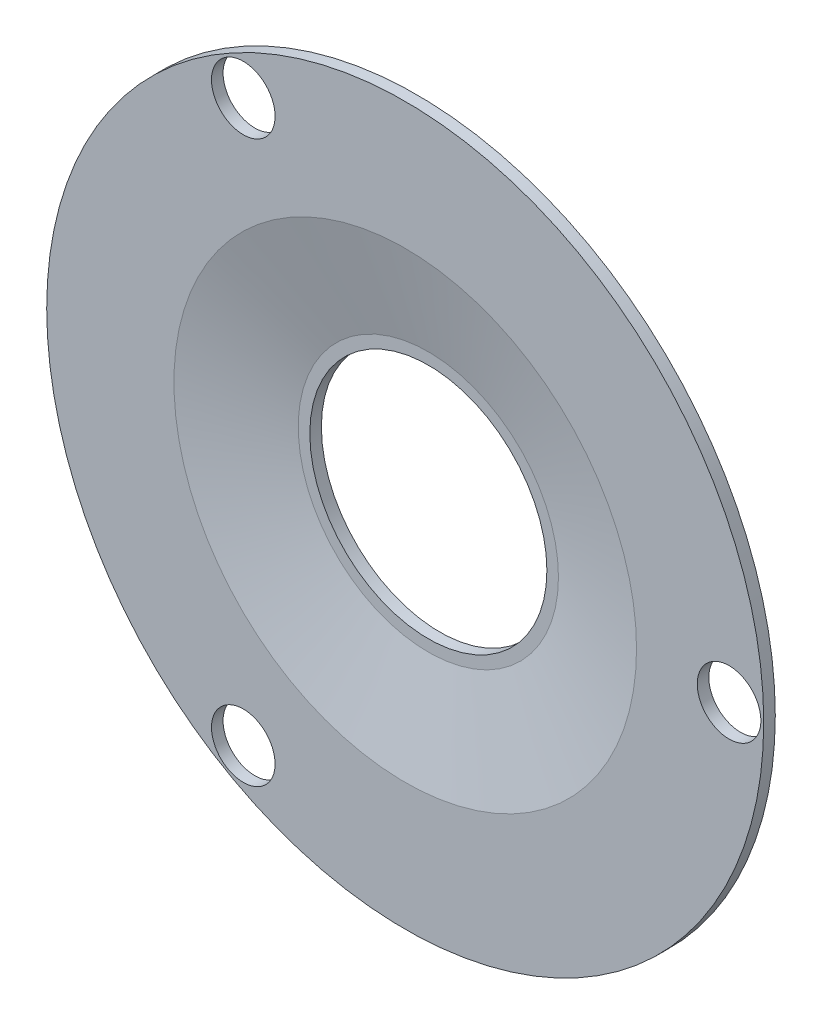
ISO-10303-21;
HEADER;
FILE_DESCRIPTION(('STEP AP214'),'2;1');
FILE_NAME('part.step','',(''),(''),'','','');
FILE_SCHEMA(('AUTOMOTIVE_DESIGN { 1 0 10303 214 1 1 1 1 }'));
ENDSEC;
DATA;
#1=APPLICATION_CONTEXT('core data for automotive mechanical design processes');
#2=APPLICATION_PROTOCOL_DEFINITION('international standard','automotive_design',2000,#1);
#3=PRODUCT_CONTEXT('',#1,'mechanical');
#4=PRODUCT('Part','Part','',(#3));
#5=PRODUCT_RELATED_PRODUCT_CATEGORY('part','',(#4));
#6=PRODUCT_DEFINITION_FORMATION('','',#4);
#7=PRODUCT_DEFINITION_CONTEXT('part definition',#1,'design');
#8=PRODUCT_DEFINITION('design','',#6,#7);
#9=PRODUCT_DEFINITION_SHAPE('','',#8);
#10=(LENGTH_UNIT() NAMED_UNIT(*) SI_UNIT(.MILLI.,.METRE.));
#11=(NAMED_UNIT(*) PLANE_ANGLE_UNIT() SI_UNIT($,.RADIAN.));
#12=(NAMED_UNIT(*) SI_UNIT($,.STERADIAN.) SOLID_ANGLE_UNIT());
#13=UNCERTAINTY_MEASURE_WITH_UNIT(LENGTH_MEASURE(1.E-05),#10,'distance_accuracy_value','');
#14=(GEOMETRIC_REPRESENTATION_CONTEXT(3) GLOBAL_UNCERTAINTY_ASSIGNED_CONTEXT((#13)) GLOBAL_UNIT_ASSIGNED_CONTEXT((#10,
#11,#12)) REPRESENTATION_CONTEXT('',''));
#15=CARTESIAN_POINT('',(0.,0.,0.));
#16=DIRECTION('',(0.,0.,1.));
#17=DIRECTION('',(1.,0.,0.));
#18=AXIS2_PLACEMENT_3D('',#15,#16,#17);
#19=CARTESIAN_POINT('',(0.,0.,-1.5));
#20=DIRECTION('',(0.,0.,1.));
#21=DIRECTION('',(1.,0.,0.));
#22=AXIS2_PLACEMENT_3D('',#19,#20,#21);
#23=CYLINDRICAL_SURFACE('',#22,10.25);
#24=CARTESIAN_POINT('',(0.,0.,-1.5));
#25=DIRECTION('',(0.,0.,1.));
#26=DIRECTION('',(1.,0.,0.));
#27=AXIS2_PLACEMENT_3D('',#24,#25,#26);
#28=CIRCLE('',#27,10.25);
#29=CARTESIAN_POINT('',(10.25,0.,-1.5));
#30=VERTEX_POINT('',#29);
#31=EDGE_CURVE('E59',#30,#30,#28,.F.);
#32=ORIENTED_EDGE('',*,*,#31,.T.);
#33=EDGE_LOOP('',(#32));
#34=FACE_BOUND('',#33,.T.);
#35=CARTESIAN_POINT('',(0.,0.,-0.5));
#36=DIRECTION('',(0.,0.,1.));
#37=DIRECTION('',(1.,0.,0.));
#38=AXIS2_PLACEMENT_3D('',#35,#36,#37);
#39=CIRCLE('',#38,10.25);
#40=CARTESIAN_POINT('',(10.25,0.,-0.5));
#41=VERTEX_POINT('',#40);
#42=EDGE_CURVE('E19',#41,#41,#39,.T.);
#43=ORIENTED_EDGE('',*,*,#42,.T.);
#44=EDGE_LOOP('',(#43));
#45=FACE_BOUND('',#44,.T.);
#46=ADVANCED_FACE('F15',(#34,#45),#23,.F.);
#47=CARTESIAN_POINT('',(11.385,-11.385,-0.5));
#48=DIRECTION('',(0.,0.,-1.));
#49=DIRECTION('',(-1.,0.,0.));
#50=AXIS2_PLACEMENT_3D('',#47,#48,#49);
#51=PLANE('',#50);
#52=ORIENTED_EDGE('',*,*,#42,.F.);
#53=EDGE_LOOP('',(#52));
#54=FACE_BOUND('',#53,.T.);
#55=CARTESIAN_POINT('',(0.,0.,-0.5));
#56=DIRECTION('',(0.,0.,1.));
#57=DIRECTION('',(1.,0.,0.));
#58=AXIS2_PLACEMENT_3D('',#55,#56,#57);
#59=CIRCLE('',#58,11.25);
#60=CARTESIAN_POINT('',(11.25,0.,-0.5));
#61=VERTEX_POINT('',#60);
#62=EDGE_CURVE('E57',#61,#61,#59,.F.);
#63=ORIENTED_EDGE('',*,*,#62,.F.);
#64=EDGE_LOOP('',(#63));
#65=FACE_BOUND('',#64,.T.);
#66=ADVANCED_FACE('F67',(#54,#65),#51,.F.);
#67=CARTESIAN_POINT('',(-11.499184737,-11.499184737,-1.5));
#68=DIRECTION('',(0.,0.,1.));
#69=DIRECTION('',(1.,0.,0.));
#70=AXIS2_PLACEMENT_3D('',#67,#68,#69);
#71=PLANE('',#70);
#72=ORIENTED_EDGE('',*,*,#31,.F.);
#73=EDGE_LOOP('',(#72));
#74=FACE_BOUND('',#73,.T.);
#75=CARTESIAN_POINT('',(0.,0.,-1.50000000000006));
#76=DIRECTION('',(0.,0.,1.));
#77=DIRECTION('',(1.,0.,0.));
#78=AXIS2_PLACEMENT_3D('',#75,#76,#77);
#79=CIRCLE('',#78,11.3628307679998);
#80=CARTESIAN_POINT('',(11.3628307679998,0.,-1.50000000000006));
#81=VERTEX_POINT('',#80);
#82=EDGE_CURVE('E54',#81,#81,#79,.F.);
#83=ORIENTED_EDGE('',*,*,#82,.T.);
#84=EDGE_LOOP('',(#83));
#85=FACE_BOUND('',#84,.T.);
#86=ADVANCED_FACE('F70',(#74,#85),#71,.F.);
#87=CARTESIAN_POINT('',(0.,0.,-0.5));
#88=DIRECTION('',(0.,0.,1.));
#89=DIRECTION('',(1.,0.,0.));
#90=AXIS2_PLACEMENT_3D('',#87,#88,#89);
#91=CONICAL_SURFACE('',#90,11.25,1.34608515838025);
#92=ORIENTED_EDGE('',*,*,#62,.T.);
#93=EDGE_LOOP('',(#92));
#94=FACE_BOUND('',#93,.T.);
#95=CARTESIAN_POINT('',(0.,0.,1.49999999999995));
#96=DIRECTION('',(0.,0.,1.));
#97=DIRECTION('',(1.,0.,0.));
#98=AXIS2_PLACEMENT_3D('',#95,#96,#97);
#99=CIRCLE('',#98,19.9999999999998);
#100=CARTESIAN_POINT('',(19.9999999999998,0.,1.49999999999995));
#101=VERTEX_POINT('',#100);
#102=EDGE_CURVE('E42',#101,#101,#99,.T.);
#103=ORIENTED_EDGE('',*,*,#102,.T.);
#104=EDGE_LOOP('',(#103));
#105=FACE_BOUND('',#104,.T.);
#106=ADVANCED_FACE('F74',(#94,#105),#91,.F.);
#107=CARTESIAN_POINT('',(0.,0.,0.5));
#108=DIRECTION('',(0.,0.,1.));
#109=DIRECTION('',(1.,0.,0.));
#110=AXIS2_PLACEMENT_3D('',#107,#108,#109);
#111=CYLINDRICAL_SURFACE('',#110,31.);
#112=CARTESIAN_POINT('',(0.,0.,1.5));
#113=DIRECTION('',(0.,0.,1.));
#114=DIRECTION('',(1.,0.,0.));
#115=AXIS2_PLACEMENT_3D('',#112,#113,#114);
#116=CIRCLE('',#115,31.);
#117=CARTESIAN_POINT('',(31.,0.,1.5));
#118=VERTEX_POINT('',#117);
#119=EDGE_CURVE('E51',#118,#118,#116,.F.);
#120=ORIENTED_EDGE('',*,*,#119,.T.);
#121=EDGE_LOOP('',(#120));
#122=FACE_BOUND('',#121,.T.);
#123=CARTESIAN_POINT('',(0.,0.,0.5));
#124=DIRECTION('',(0.,0.,1.));
#125=DIRECTION('',(1.,0.,0.));
#126=AXIS2_PLACEMENT_3D('',#123,#124,#125);
#127=CIRCLE('',#126,31.);
#128=CARTESIAN_POINT('',(31.,0.,0.5));
#129=VERTEX_POINT('',#128);
#130=EDGE_CURVE('E39',#129,#129,#127,.T.);
#131=ORIENTED_EDGE('',*,*,#130,.T.);
#132=EDGE_LOOP('',(#131));
#133=FACE_BOUND('',#132,.T.);
#134=ADVANCED_FACE('F77',(#122,#133),#111,.T.);
#135=CARTESIAN_POINT('',(-14.,24.248711306,1.5));
#136=DIRECTION('',(0.,0.,-1.));
#137=DIRECTION('',(-1.,0.,0.));
#138=AXIS2_PLACEMENT_3D('',#135,#136,#137);
#139=CYLINDRICAL_SURFACE('',#138,2.75);
#140=CARTESIAN_POINT('',(-14.,24.248711306,1.5));
#141=DIRECTION('',(0.,0.,-1.));
#142=DIRECTION('',(-1.,0.,0.));
#143=AXIS2_PLACEMENT_3D('',#140,#141,#142);
#144=CIRCLE('',#143,2.75);
#145=CARTESIAN_POINT('',(-16.75,24.248711306,1.5));
#146=VERTEX_POINT('',#145);
#147=EDGE_CURVE('E48',#146,#146,#144,.F.);
#148=ORIENTED_EDGE('',*,*,#147,.T.);
#149=EDGE_LOOP('',(#148));
#150=FACE_BOUND('',#149,.T.);
#151=CARTESIAN_POINT('',(-14.,24.248711306,0.5));
#152=DIRECTION('',(0.,0.,-1.));
#153=DIRECTION('',(-1.,0.,0.));
#154=AXIS2_PLACEMENT_3D('',#151,#152,#153);
#155=CIRCLE('',#154,2.75);
#156=CARTESIAN_POINT('',(-16.75,24.248711306,0.5));
#157=VERTEX_POINT('',#156);
#158=EDGE_CURVE('E36',#157,#157,#155,.T.);
#159=ORIENTED_EDGE('',*,*,#158,.T.);
#160=EDGE_LOOP('',(#159));
#161=FACE_BOUND('',#160,.T.);
#162=ADVANCED_FACE('F95',(#150,#161),#139,.F.);
#163=CARTESIAN_POINT('',(0.,0.,-1.5));
#164=DIRECTION('',(0.,0.,1.));
#165=DIRECTION('',(1.,0.,0.));
#166=AXIS2_PLACEMENT_3D('',#163,#164,#165);
#167=CONICAL_SURFACE('',#166,11.362830768,1.34608515838025);
#168=CARTESIAN_POINT('',(0.,0.,0.499999999999945));
#169=DIRECTION('',(0.,0.,1.));
#170=DIRECTION('',(1.,0.,0.));
#171=AXIS2_PLACEMENT_3D('',#168,#169,#170);
#172=CIRCLE('',#171,20.1128307679998);
#173=CARTESIAN_POINT('',(20.1128307679998,0.,0.499999999999945));
#174=VERTEX_POINT('',#173);
#175=EDGE_CURVE('E33',#174,#174,#172,.F.);
#176=ORIENTED_EDGE('',*,*,#175,.T.);
#177=EDGE_LOOP('',(#176));
#178=FACE_BOUND('',#177,.T.);
#179=ORIENTED_EDGE('',*,*,#82,.F.);
#180=EDGE_LOOP('',(#179));
#181=FACE_BOUND('',#180,.T.);
#182=ADVANCED_FACE('F116',(#178,#181),#167,.T.);
#183=CARTESIAN_POINT('',(-14.,-24.248711306,1.5));
#184=DIRECTION('',(0.,0.,-1.));
#185=DIRECTION('',(-1.,0.,0.));
#186=AXIS2_PLACEMENT_3D('',#183,#184,#185);
#187=CYLINDRICAL_SURFACE('',#186,2.75);
#188=CARTESIAN_POINT('',(-14.,-24.248711306,1.5));
#189=DIRECTION('',(0.,0.,-1.));
#190=DIRECTION('',(-1.,0.,0.));
#191=AXIS2_PLACEMENT_3D('',#188,#189,#190);
#192=CIRCLE('',#191,2.75);
#193=CARTESIAN_POINT('',(-16.75,-24.248711306,1.5));
#194=VERTEX_POINT('',#193);
#195=EDGE_CURVE('E45',#194,#194,#192,.F.);
#196=ORIENTED_EDGE('',*,*,#195,.T.);
#197=EDGE_LOOP('',(#196));
#198=FACE_BOUND('',#197,.T.);
#199=CARTESIAN_POINT('',(-14.,-24.248711306,0.5));
#200=DIRECTION('',(0.,0.,-1.));
#201=DIRECTION('',(-1.,0.,0.));
#202=AXIS2_PLACEMENT_3D('',#199,#200,#201);
#203=CIRCLE('',#202,2.75);
#204=CARTESIAN_POINT('',(-16.75,-24.248711306,0.5));
#205=VERTEX_POINT('',#204);
#206=EDGE_CURVE('E28',#205,#205,#203,.T.);
#207=ORIENTED_EDGE('',*,*,#206,.T.);
#208=EDGE_LOOP('',(#207));
#209=FACE_BOUND('',#208,.T.);
#210=ADVANCED_FACE('F84',(#198,#209),#187,.F.);
#211=CARTESIAN_POINT('',(31.372,-31.372,1.5));
#212=DIRECTION('',(0.,0.,-1.));
#213=DIRECTION('',(-1.,0.,0.));
#214=AXIS2_PLACEMENT_3D('',#211,#212,#213);
#215=PLANE('',#214);
#216=ORIENTED_EDGE('',*,*,#102,.F.);
#217=EDGE_LOOP('',(#216));
#218=FACE_BOUND('',#217,.T.);
#219=ORIENTED_EDGE('',*,*,#195,.F.);
#220=EDGE_LOOP('',(#219));
#221=FACE_BOUND('',#220,.T.);
#222=ORIENTED_EDGE('',*,*,#147,.F.);
#223=EDGE_LOOP('',(#222));
#224=FACE_BOUND('',#223,.T.);
#225=CARTESIAN_POINT('',(28.,0.,1.5));
#226=DIRECTION('',(0.,0.,-1.));
#227=DIRECTION('',(-1.,0.,0.));
#228=AXIS2_PLACEMENT_3D('',#225,#226,#227);
#229=CIRCLE('',#228,2.75);
#230=CARTESIAN_POINT('',(25.25,0.,1.5));
#231=VERTEX_POINT('',#230);
#232=EDGE_CURVE('E23',#231,#231,#229,.F.);
#233=ORIENTED_EDGE('',*,*,#232,.F.);
#234=EDGE_LOOP('',(#233));
#235=FACE_BOUND('',#234,.T.);
#236=ORIENTED_EDGE('',*,*,#119,.F.);
#237=EDGE_LOOP('',(#236));
#238=FACE_BOUND('',#237,.T.);
#239=ADVANCED_FACE('F81',(#218,#221,#224,#235,#238),#215,.F.);
#240=CARTESIAN_POINT('',(-31.372,-31.372,0.5));
#241=DIRECTION('',(0.,0.,1.));
#242=DIRECTION('',(1.,0.,0.));
#243=AXIS2_PLACEMENT_3D('',#240,#241,#242);
#244=PLANE('',#243);
#245=ORIENTED_EDGE('',*,*,#206,.F.);
#246=EDGE_LOOP('',(#245));
#247=FACE_BOUND('',#246,.T.);
#248=ORIENTED_EDGE('',*,*,#175,.F.);
#249=EDGE_LOOP('',(#248));
#250=FACE_BOUND('',#249,.T.);
#251=ORIENTED_EDGE('',*,*,#158,.F.);
#252=EDGE_LOOP('',(#251));
#253=FACE_BOUND('',#252,.T.);
#254=CARTESIAN_POINT('',(28.,0.,0.5));
#255=DIRECTION('',(0.,0.,-1.));
#256=DIRECTION('',(-1.,0.,0.));
#257=AXIS2_PLACEMENT_3D('',#254,#255,#256);
#258=CIRCLE('',#257,2.75);
#259=CARTESIAN_POINT('',(25.25,0.,0.5));
#260=VERTEX_POINT('',#259);
#261=EDGE_CURVE('E10',#260,#260,#258,.T.);
#262=ORIENTED_EDGE('',*,*,#261,.F.);
#263=EDGE_LOOP('',(#262));
#264=FACE_BOUND('',#263,.T.);
#265=ORIENTED_EDGE('',*,*,#130,.F.);
#266=EDGE_LOOP('',(#265));
#267=FACE_BOUND('',#266,.T.);
#268=ADVANCED_FACE('F17',(#247,#250,#253,#264,#267),#244,.F.);
#269=CARTESIAN_POINT('',(28.,0.,1.5));
#270=DIRECTION('',(0.,0.,-1.));
#271=DIRECTION('',(-1.,0.,0.));
#272=AXIS2_PLACEMENT_3D('',#269,#270,#271);
#273=CYLINDRICAL_SURFACE('',#272,2.75);
#274=ORIENTED_EDGE('',*,*,#232,.T.);
#275=EDGE_LOOP('',(#274));
#276=FACE_BOUND('',#275,.T.);
#277=ORIENTED_EDGE('',*,*,#261,.T.);
#278=EDGE_LOOP('',(#277));
#279=FACE_BOUND('',#278,.T.);
#280=ADVANCED_FACE('F100',(#276,#279),#273,.F.);
#281=CLOSED_SHELL('',(#46,#66,#86,#106,#134,#162,#182,#210,#239,#268,#280));
#282=MANIFOLD_SOLID_BREP('B1',#281);
#283=ADVANCED_BREP_SHAPE_REPRESENTATION('',(#18,#282),#14);
#284=SHAPE_DEFINITION_REPRESENTATION(#9,#283);
ENDSEC;
END-ISO-10303-21;
